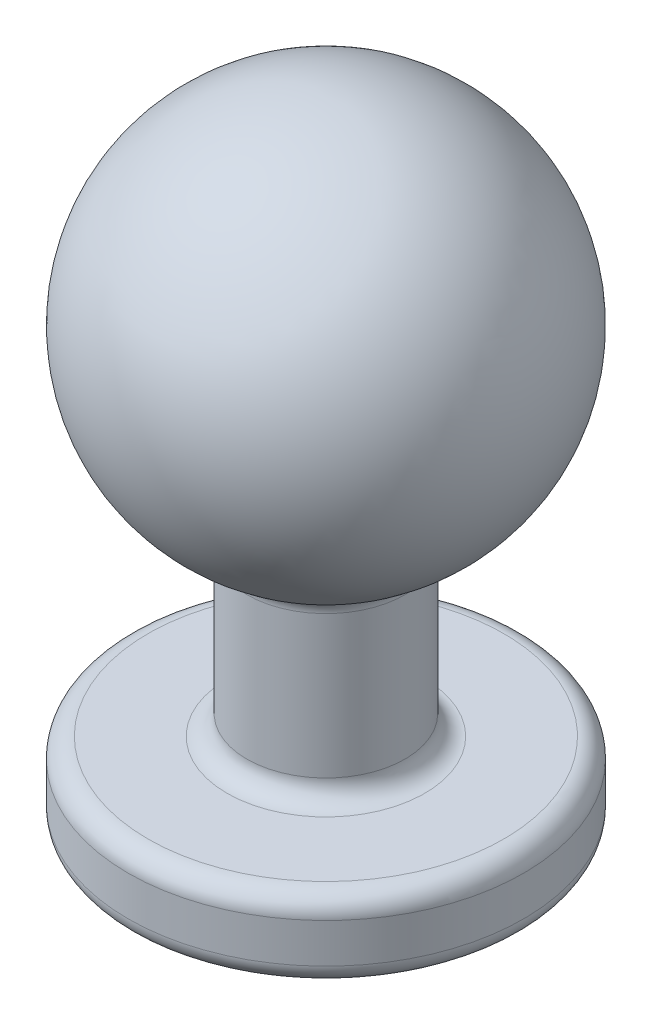
ISO-10303-21;
HEADER;
FILE_DESCRIPTION(('STEP AP214'),'2;1');
FILE_NAME('part.step','',(''),(''),'','','');
FILE_SCHEMA(('AUTOMOTIVE_DESIGN { 1 0 10303 214 1 1 1 1 }'));
ENDSEC;
DATA;
#1=APPLICATION_CONTEXT('core data for automotive mechanical design processes');
#2=APPLICATION_PROTOCOL_DEFINITION('international standard','automotive_design',2000,#1);
#3=PRODUCT_CONTEXT('',#1,'mechanical');
#4=PRODUCT('Part','Part','',(#3));
#5=PRODUCT_RELATED_PRODUCT_CATEGORY('part','',(#4));
#6=PRODUCT_DEFINITION_FORMATION('','',#4);
#7=PRODUCT_DEFINITION_CONTEXT('part definition',#1,'design');
#8=PRODUCT_DEFINITION('design','',#6,#7);
#9=PRODUCT_DEFINITION_SHAPE('','',#8);
#10=(LENGTH_UNIT() NAMED_UNIT(*) SI_UNIT(.MILLI.,.METRE.));
#11=(NAMED_UNIT(*) PLANE_ANGLE_UNIT() SI_UNIT($,.RADIAN.));
#12=(NAMED_UNIT(*) SI_UNIT($,.STERADIAN.) SOLID_ANGLE_UNIT());
#13=UNCERTAINTY_MEASURE_WITH_UNIT(LENGTH_MEASURE(1.E-05),#10,'distance_accuracy_value','');
#14=(GEOMETRIC_REPRESENTATION_CONTEXT(3) GLOBAL_UNCERTAINTY_ASSIGNED_CONTEXT((#13)) GLOBAL_UNIT_ASSIGNED_CONTEXT((#10,
#11,#12)) REPRESENTATION_CONTEXT('',''));
#15=CARTESIAN_POINT('',(0.,0.,0.));
#16=DIRECTION('',(0.,0.,1.));
#17=DIRECTION('',(1.,0.,0.));
#18=AXIS2_PLACEMENT_3D('',#15,#16,#17);
#19=CARTESIAN_POINT('',(0.,-2.,0.));
#20=DIRECTION('',(0.,1.,0.));
#21=DIRECTION('',(0.,0.,1.));
#22=AXIS2_PLACEMENT_3D('',#19,#20,#21);
#23=PLANE('',#22);
#24=CARTESIAN_POINT('',(0.,-2.,0.));
#25=DIRECTION('',(0.,1.,0.));
#26=DIRECTION('',(0.,0.,1.));
#27=AXIS2_PLACEMENT_3D('',#24,#25,#26);
#28=CIRCLE('',#27,4.5);
#29=CARTESIAN_POINT('',(0.,-2.,4.5));
#30=VERTEX_POINT('',#29);
#31=EDGE_CURVE('E10',#30,#30,#28,.T.);
#32=ORIENTED_EDGE('',*,*,#31,.F.);
#33=EDGE_LOOP('',(#32));
#34=FACE_BOUND('',#33,.T.);
#35=ADVANCED_FACE('F32',(#34),#23,.F.);
#36=CARTESIAN_POINT('',(0.,-1.5,0.));
#37=DIRECTION('',(0.,1.,0.));
#38=DIRECTION('',(0.,0.,1.));
#39=AXIS2_PLACEMENT_3D('',#36,#37,#38);
#40=TOROIDAL_SURFACE('',#39,4.50000000000001,0.5);
#41=CARTESIAN_POINT('',(0.,-1.5,0.));
#42=DIRECTION('',(0.,1.,0.));
#43=DIRECTION('',(0.,0.,1.));
#44=AXIS2_PLACEMENT_3D('',#41,#42,#43);
#45=CIRCLE('',#44,5.00000000000001);
#46=CARTESIAN_POINT('',(0.,-1.5,5.00000000000001));
#47=VERTEX_POINT('',#46);
#48=EDGE_CURVE('E38',#47,#47,#45,.T.);
#49=ORIENTED_EDGE('',*,*,#48,.F.);
#50=EDGE_LOOP('',(#49));
#51=FACE_BOUND('',#50,.T.);
#52=ORIENTED_EDGE('',*,*,#31,.T.);
#53=EDGE_LOOP('',(#52));
#54=FACE_BOUND('',#53,.T.);
#55=ADVANCED_FACE('F98',(#51,#54),#40,.T.);
#56=CARTESIAN_POINT('',(0.,14.752492259818,0.));
#57=DIRECTION('',(0.,1.,0.));
#58=DIRECTION('',(0.,0.,1.));
#59=AXIS2_PLACEMENT_3D('',#56,#57,#58);
#60=CYLINDRICAL_SURFACE('',#59,5.00000000000001);
#61=CARTESIAN_POINT('',(0.,-0.500000000000004,0.));
#62=DIRECTION('',(0.,1.,0.));
#63=DIRECTION('',(0.,0.,1.));
#64=AXIS2_PLACEMENT_3D('',#61,#62,#63);
#65=CIRCLE('',#64,5.00000000000001);
#66=CARTESIAN_POINT('',(0.,-0.500000000000004,5.00000000000001));
#67=VERTEX_POINT('',#66);
#68=EDGE_CURVE('E42',#67,#67,#65,.T.);
#69=ORIENTED_EDGE('',*,*,#68,.F.);
#70=EDGE_LOOP('',(#69));
#71=FACE_BOUND('',#70,.T.);
#72=ORIENTED_EDGE('',*,*,#48,.T.);
#73=EDGE_LOOP('',(#72));
#74=FACE_BOUND('',#73,.T.);
#75=ADVANCED_FACE('F93',(#71,#74),#60,.T.);
#76=CARTESIAN_POINT('',(0.,-0.5,0.));
#77=DIRECTION('',(0.,1.,0.));
#78=DIRECTION('',(0.,0.,1.));
#79=AXIS2_PLACEMENT_3D('',#76,#77,#78);
#80=TOROIDAL_SURFACE('',#79,4.50000000000001,0.5);
#81=CARTESIAN_POINT('',(0.,0.,0.));
#82=DIRECTION('',(0.,1.,0.));
#83=DIRECTION('',(0.,0.,1.));
#84=AXIS2_PLACEMENT_3D('',#81,#82,#83);
#85=CIRCLE('',#84,4.5);
#86=CARTESIAN_POINT('',(0.,0.,4.5));
#87=VERTEX_POINT('',#86);
#88=EDGE_CURVE('E46',#87,#87,#85,.T.);
#89=ORIENTED_EDGE('',*,*,#88,.F.);
#90=EDGE_LOOP('',(#89));
#91=FACE_BOUND('',#90,.T.);
#92=ORIENTED_EDGE('',*,*,#68,.T.);
#93=EDGE_LOOP('',(#92));
#94=FACE_BOUND('',#93,.T.);
#95=ADVANCED_FACE('F87',(#91,#94),#80,.T.);
#96=CARTESIAN_POINT('',(4.5,0.,0.));
#97=DIRECTION('',(0.,-1.,0.));
#98=DIRECTION('',(0.,0.,-1.));
#99=AXIS2_PLACEMENT_3D('',#96,#97,#98);
#100=PLANE('',#99);
#101=CARTESIAN_POINT('',(0.,0.,0.));
#102=DIRECTION('',(0.,1.,0.));
#103=DIRECTION('',(0.,0.,1.));
#104=AXIS2_PLACEMENT_3D('',#101,#102,#103);
#105=CIRCLE('',#104,2.50000000000001);
#106=CARTESIAN_POINT('',(0.,0.,2.50000000000001));
#107=VERTEX_POINT('',#106);
#108=EDGE_CURVE('E51',#107,#107,#105,.T.);
#109=ORIENTED_EDGE('',*,*,#108,.F.);
#110=EDGE_LOOP('',(#109));
#111=FACE_BOUND('',#110,.T.);
#112=ORIENTED_EDGE('',*,*,#88,.T.);
#113=EDGE_LOOP('',(#112));
#114=FACE_BOUND('',#113,.T.);
#115=ADVANCED_FACE('F81',(#111,#114),#100,.F.);
#116=CARTESIAN_POINT('',(0.,0.5,0.));
#117=DIRECTION('',(0.,1.,0.));
#118=DIRECTION('',(0.,0.,1.));
#119=AXIS2_PLACEMENT_3D('',#116,#117,#118);
#120=TOROIDAL_SURFACE('',#119,2.5,0.5);
#121=CARTESIAN_POINT('',(0.,0.5,0.));
#122=DIRECTION('',(0.,1.,0.));
#123=DIRECTION('',(0.,0.,1.));
#124=AXIS2_PLACEMENT_3D('',#121,#122,#123);
#125=CIRCLE('',#124,2.);
#126=CARTESIAN_POINT('',(0.,0.5,2.));
#127=VERTEX_POINT('',#126);
#128=EDGE_CURVE('E54',#127,#127,#125,.T.);
#129=ORIENTED_EDGE('',*,*,#128,.F.);
#130=EDGE_LOOP('',(#129));
#131=FACE_BOUND('',#130,.T.);
#132=ORIENTED_EDGE('',*,*,#108,.T.);
#133=EDGE_LOOP('',(#132));
#134=FACE_BOUND('',#133,.T.);
#135=ADVANCED_FACE('F75',(#131,#134),#120,.F.);
#136=CARTESIAN_POINT('',(0.,14.752492259818,0.));
#137=DIRECTION('',(0.,1.,0.));
#138=DIRECTION('',(0.,0.,1.));
#139=AXIS2_PLACEMENT_3D('',#136,#137,#138);
#140=CYLINDRICAL_SURFACE('',#139,2.);
#141=CARTESIAN_POINT('',(0.,4.10102051443365,0.));
#142=DIRECTION('',(0.,1.,0.));
#143=DIRECTION('',(0.,0.,1.));
#144=AXIS2_PLACEMENT_3D('',#141,#142,#143);
#145=CIRCLE('',#144,2.);
#146=CARTESIAN_POINT('',(0.,4.10102051443365,2.));
#147=VERTEX_POINT('',#146);
#148=EDGE_CURVE('E57',#147,#147,#145,.T.);
#149=ORIENTED_EDGE('',*,*,#148,.F.);
#150=EDGE_LOOP('',(#149));
#151=FACE_BOUND('',#150,.T.);
#152=ORIENTED_EDGE('',*,*,#128,.T.);
#153=EDGE_LOOP('',(#152));
#154=FACE_BOUND('',#153,.T.);
#155=ADVANCED_FACE('F69',(#151,#154),#140,.T.);
#156=CARTESIAN_POINT('',(0.,4.10102051443365,0.));
#157=DIRECTION('',(0.,1.,0.));
#158=DIRECTION('',(0.,0.,1.));
#159=AXIS2_PLACEMENT_3D('',#156,#157,#158);
#160=TOROIDAL_SURFACE('',#159,2.5,0.5);
#161=CARTESIAN_POINT('',(0.,4.54638228584877,0.));
#162=DIRECTION('',(0.,1.,0.));
#163=DIRECTION('',(0.,0.,1.));
#164=AXIS2_PLACEMENT_3D('',#161,#162,#163);
#165=CIRCLE('',#164,2.27272727272727);
#166=CARTESIAN_POINT('',(0.,4.54638228584877,2.27272727272727));
#167=VERTEX_POINT('',#166);
#168=EDGE_CURVE('E60',#167,#167,#165,.T.);
#169=ORIENTED_EDGE('',*,*,#168,.F.);
#170=EDGE_LOOP('',(#169));
#171=FACE_BOUND('',#170,.T.);
#172=ORIENTED_EDGE('',*,*,#148,.T.);
#173=EDGE_LOOP('',(#172));
#174=FACE_BOUND('',#173,.T.);
#175=ADVANCED_FACE('F66',(#171,#174),#160,.F.);
#176=CARTESIAN_POINT('',(0.,9.,0.));
#177=DIRECTION('',(0.,1.,0.));
#178=DIRECTION('',(1.,0.,0.));
#179=AXIS2_PLACEMENT_3D('',#176,#177,#178);
#180=SPHERICAL_SURFACE('',#179,5.);
#181=ORIENTED_EDGE('',*,*,#168,.T.);
#182=EDGE_LOOP('',(#181));
#183=FACE_BOUND('',#182,.T.);
#184=ADVANCED_FACE('F64',(#183),#180,.T.);
#185=CLOSED_SHELL('',(#35,#55,#75,#95,#115,#135,#155,#175,#184));
#186=MANIFOLD_SOLID_BREP('B2',#185);
#187=ADVANCED_BREP_SHAPE_REPRESENTATION('',(#18,#186),#14);
#188=SHAPE_DEFINITION_REPRESENTATION(#9,#187);
ENDSEC;
END-ISO-10303-21;
